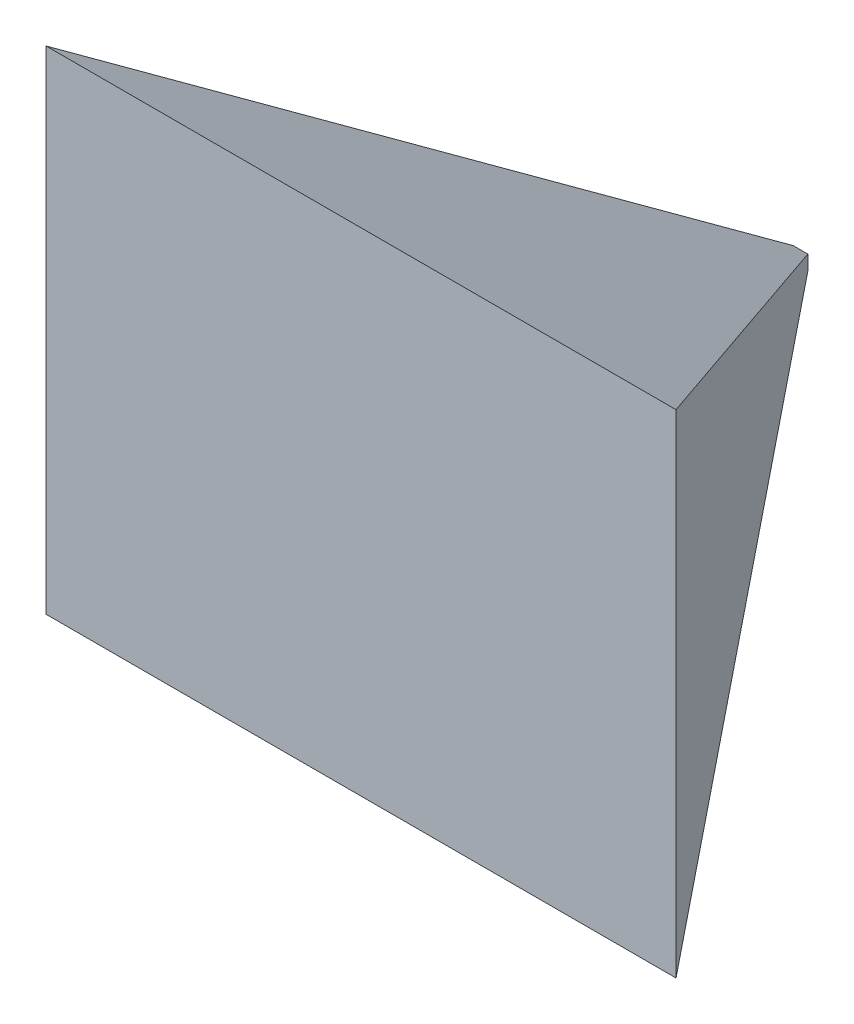
ISO-10303-21;
HEADER;
FILE_DESCRIPTION(('STEP AP214'),'2;1');
FILE_NAME('part.step','',(''),(''),'','','');
FILE_SCHEMA(('AUTOMOTIVE_DESIGN { 1 0 10303 214 1 1 1 1 }'));
ENDSEC;
DATA;
#1=APPLICATION_CONTEXT('core data for automotive mechanical design processes');
#2=APPLICATION_PROTOCOL_DEFINITION('international standard','automotive_design',2000,#1);
#3=PRODUCT_CONTEXT('',#1,'mechanical');
#4=PRODUCT('Part','Part','',(#3));
#5=PRODUCT_RELATED_PRODUCT_CATEGORY('part','',(#4));
#6=PRODUCT_DEFINITION_FORMATION('','',#4);
#7=PRODUCT_DEFINITION_CONTEXT('part definition',#1,'design');
#8=PRODUCT_DEFINITION('design','',#6,#7);
#9=PRODUCT_DEFINITION_SHAPE('','',#8);
#10=(LENGTH_UNIT() NAMED_UNIT(*) SI_UNIT(.MILLI.,.METRE.));
#11=(NAMED_UNIT(*) PLANE_ANGLE_UNIT() SI_UNIT($,.RADIAN.));
#12=(NAMED_UNIT(*) SI_UNIT($,.STERADIAN.) SOLID_ANGLE_UNIT());
#13=UNCERTAINTY_MEASURE_WITH_UNIT(LENGTH_MEASURE(1.E-05),#10,'distance_accuracy_value','');
#14=(GEOMETRIC_REPRESENTATION_CONTEXT(3) GLOBAL_UNCERTAINTY_ASSIGNED_CONTEXT((#13)) GLOBAL_UNIT_ASSIGNED_CONTEXT((#10,
#11,#12)) REPRESENTATION_CONTEXT('',''));
#15=CARTESIAN_POINT('',(0.,0.,0.));
#16=DIRECTION('',(0.,0.,1.));
#17=DIRECTION('',(1.,0.,0.));
#18=AXIS2_PLACEMENT_3D('',#15,#16,#17);
#19=CARTESIAN_POINT('',(-215.,-168.,300.));
#20=DIRECTION('',(0.,0.,1.));
#21=DIRECTION('',(1.,0.,0.));
#22=AXIS2_PLACEMENT_3D('',#19,#20,#21);
#23=PLANE('',#22);
#24=DIRECTION('',(0.,-1.,0.));
#25=VECTOR('',#24,1.);
#26=CARTESIAN_POINT('',(-215.,168.,300.));
#27=LINE('',#26,#25);
#28=CARTESIAN_POINT('',(-215.,168.,300.));
#29=VERTEX_POINT('',#28);
#30=CARTESIAN_POINT('',(-215.,-168.,300.));
#31=VERTEX_POINT('',#30);
#32=EDGE_CURVE('E136',#29,#31,#27,.T.);
#33=ORIENTED_EDGE('',*,*,#32,.T.);
#34=DIRECTION('',(1.,0.,0.));
#35=VECTOR('',#34,1.);
#36=CARTESIAN_POINT('',(-215.,-168.,300.));
#37=LINE('',#36,#35);
#38=CARTESIAN_POINT('',(215.,-168.,300.));
#39=VERTEX_POINT('',#38);
#40=EDGE_CURVE('E109',#31,#39,#37,.T.);
#41=ORIENTED_EDGE('',*,*,#40,.T.);
#42=DIRECTION('',(0.,1.,0.));
#43=VECTOR('',#42,1.);
#44=CARTESIAN_POINT('',(215.,168.,300.));
#45=LINE('',#44,#43);
#46=CARTESIAN_POINT('',(215.,168.,300.));
#47=VERTEX_POINT('',#46);
#48=EDGE_CURVE('E91',#39,#47,#45,.T.);
#49=ORIENTED_EDGE('',*,*,#48,.T.);
#50=DIRECTION('',(-1.,0.,0.));
#51=VECTOR('',#50,1.);
#52=CARTESIAN_POINT('',(-215.,168.,300.));
#53=LINE('',#52,#51);
#54=EDGE_CURVE('E81',#47,#29,#53,.T.);
#55=ORIENTED_EDGE('',*,*,#54,.T.);
#56=EDGE_LOOP('',(#33,#41,#49,#55));
#57=FACE_BOUND('',#56,.T.);
#58=ADVANCED_FACE('F42',(#57),#23,.T.);
#59=CARTESIAN_POINT('',(-5.,-5.,0.));
#60=DIRECTION('',(0.,0.,1.));
#61=DIRECTION('',(1.,0.,0.));
#62=AXIS2_PLACEMENT_3D('',#59,#60,#61);
#63=PLANE('',#62);
#64=DIRECTION('',(0.,-1.,0.));
#65=VECTOR('',#64,1.);
#66=CARTESIAN_POINT('',(-5.,5.,0.));
#67=LINE('',#66,#65);
#68=CARTESIAN_POINT('',(-5.,5.,0.));
#69=VERTEX_POINT('',#68);
#70=CARTESIAN_POINT('',(-5.,-5.,0.));
#71=VERTEX_POINT('',#70);
#72=EDGE_CURVE('E96',#69,#71,#67,.T.);
#73=ORIENTED_EDGE('',*,*,#72,.F.);
#74=DIRECTION('',(-1.,0.,0.));
#75=VECTOR('',#74,1.);
#76=CARTESIAN_POINT('',(-5.,5.,0.));
#77=LINE('',#76,#75);
#78=CARTESIAN_POINT('',(5.,5.,0.));
#79=VERTEX_POINT('',#78);
#80=EDGE_CURVE('E12',#79,#69,#77,.T.);
#81=ORIENTED_EDGE('',*,*,#80,.F.);
#82=DIRECTION('',(0.,1.,0.));
#83=VECTOR('',#82,1.);
#84=CARTESIAN_POINT('',(5.,5.,0.));
#85=LINE('',#84,#83);
#86=CARTESIAN_POINT('',(5.,-5.,0.));
#87=VERTEX_POINT('',#86);
#88=EDGE_CURVE('E53',#87,#79,#85,.T.);
#89=ORIENTED_EDGE('',*,*,#88,.F.);
#90=DIRECTION('',(1.,0.,0.));
#91=VECTOR('',#90,1.);
#92=CARTESIAN_POINT('',(-5.,-5.,0.));
#93=LINE('',#92,#91);
#94=EDGE_CURVE('E62',#71,#87,#93,.T.);
#95=ORIENTED_EDGE('',*,*,#94,.F.);
#96=EDGE_LOOP('',(#73,#81,#89,#95));
#97=FACE_BOUND('',#96,.T.);
#98=ADVANCED_FACE('F216',(#97),#63,.F.);
#99=CARTESIAN_POINT('',(0.,1.11904761904762,-7.14285714285715));
#100=DIRECTION('',(0.,0.878677932136307,-0.47741500979406));
#101=DIRECTION('',(0.,0.47741500979406,0.878677932136307));
#102=AXIS2_PLACEMENT_3D('',#99,#100,#101);
#103=PLANE('',#102);
#104=DIRECTION('',(-0.523905851862117,0.406650732635834,0.748436931231596));
#105=VECTOR('',#104,1.);
#106=CARTESIAN_POINT('',(-5.,5.,0.));
#107=LINE('',#106,#105);
#108=EDGE_CURVE('E97',#69,#29,#107,.T.);
#109=ORIENTED_EDGE('',*,*,#108,.T.);
#110=ORIENTED_EDGE('',*,*,#54,.F.);
#111=DIRECTION('',(0.523905851862117,0.406650732635834,0.748436931231596));
#112=VECTOR('',#111,1.);
#113=CARTESIAN_POINT('',(5.,5.,0.));
#114=LINE('',#113,#112);
#115=EDGE_CURVE('E88',#79,#47,#114,.T.);
#116=ORIENTED_EDGE('',*,*,#115,.F.);
#117=ORIENTED_EDGE('',*,*,#80,.T.);
#118=EDGE_LOOP('',(#109,#110,#116,#117));
#119=FACE_BOUND('',#118,.T.);
#120=ADVANCED_FACE('F101',(#119),#103,.T.);
#121=CARTESIAN_POINT('',(215.,168.,300.));
#122=DIRECTION('',(-0.81923192051904,0.,0.573462344363328));
#123=DIRECTION('',(0.573462344363328,0.,0.81923192051904));
#124=AXIS2_PLACEMENT_3D('',#121,#122,#123);
#125=PLANE('',#124);
#126=ORIENTED_EDGE('',*,*,#115,.T.);
#127=ORIENTED_EDGE('',*,*,#48,.F.);
#128=DIRECTION('',(0.523905851862117,-0.406650732635834,0.748436931231596));
#129=VECTOR('',#128,1.);
#130=CARTESIAN_POINT('',(5.,-5.,0.));
#131=LINE('',#130,#129);
#132=EDGE_CURVE('E103',#87,#39,#131,.T.);
#133=ORIENTED_EDGE('',*,*,#132,.F.);
#134=ORIENTED_EDGE('',*,*,#88,.T.);
#135=EDGE_LOOP('',(#126,#127,#133,#134));
#136=FACE_BOUND('',#135,.T.);
#137=ADVANCED_FACE('F89',(#136),#125,.F.);
#138=CARTESIAN_POINT('',(-215.,-168.,300.));
#139=DIRECTION('',(0.819231920519041,0.,0.573462344363328));
#140=DIRECTION('',(0.573462344363328,0.,-0.81923192051904));
#141=AXIS2_PLACEMENT_3D('',#138,#139,#140);
#142=PLANE('',#141);
#143=DIRECTION('',(-0.523905851862117,-0.406650732635834,0.748436931231596));
#144=VECTOR('',#143,1.);
#145=CARTESIAN_POINT('',(-5.,-5.,0.));
#146=LINE('',#145,#144);
#147=EDGE_CURVE('E157',#71,#31,#146,.T.);
#148=ORIENTED_EDGE('',*,*,#147,.T.);
#149=ORIENTED_EDGE('',*,*,#32,.F.);
#150=ORIENTED_EDGE('',*,*,#108,.F.);
#151=ORIENTED_EDGE('',*,*,#72,.T.);
#152=EDGE_LOOP('',(#148,#149,#150,#151));
#153=FACE_BOUND('',#152,.T.);
#154=ADVANCED_FACE('F155',(#153),#142,.F.);
#155=CARTESIAN_POINT('',(0.,-1.11904761904762,-7.14285714285714));
#156=DIRECTION('',(0.,-0.878677932136307,-0.47741500979406));
#157=DIRECTION('',(0.,0.47741500979406,-0.878677932136307));
#158=AXIS2_PLACEMENT_3D('',#155,#156,#157);
#159=PLANE('',#158);
#160=ORIENTED_EDGE('',*,*,#132,.T.);
#161=ORIENTED_EDGE('',*,*,#40,.F.);
#162=ORIENTED_EDGE('',*,*,#147,.F.);
#163=ORIENTED_EDGE('',*,*,#94,.T.);
#164=EDGE_LOOP('',(#160,#161,#162,#163));
#165=FACE_BOUND('',#164,.T.);
#166=ADVANCED_FACE('F175',(#165),#159,.T.);
#167=CLOSED_SHELL('',(#58,#98,#120,#137,#154,#166));
#168=MANIFOLD_SOLID_BREP('B2',#167);
#169=ADVANCED_BREP_SHAPE_REPRESENTATION('',(#18,#168),#14);
#170=SHAPE_DEFINITION_REPRESENTATION(#9,#169);
ENDSEC;
END-ISO-10303-21;
